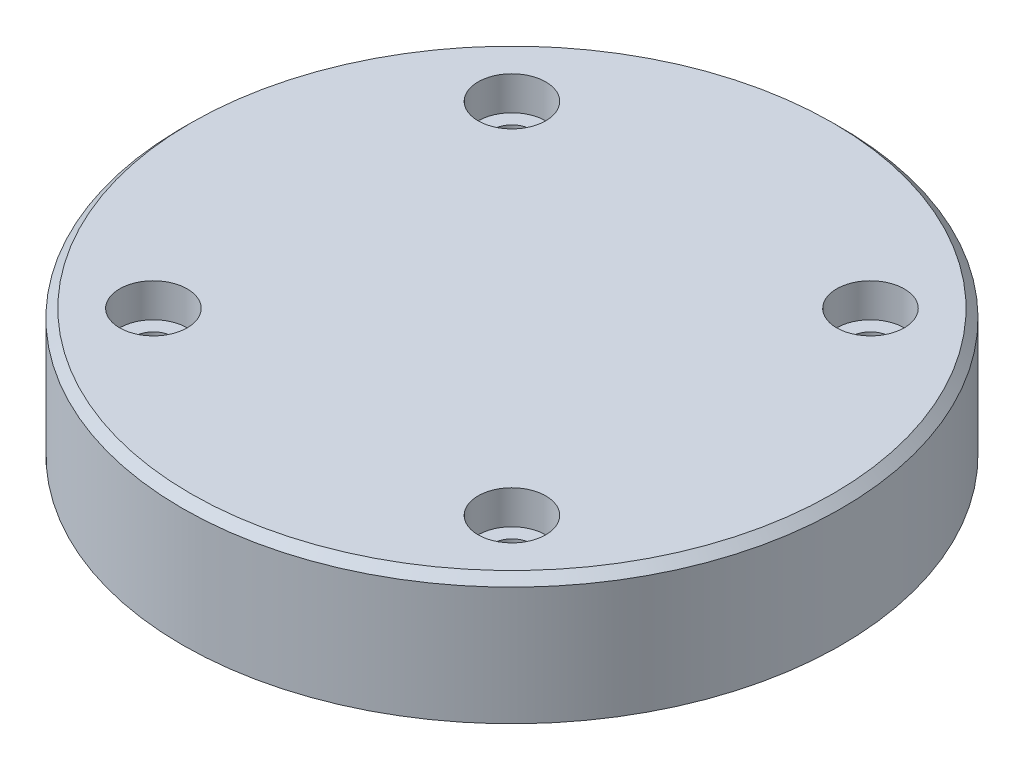
ISO-10303-21;
HEADER;
FILE_DESCRIPTION(('STEP AP214'),'2;1');
FILE_NAME('part.step','',(''),(''),'','','');
FILE_SCHEMA(('AUTOMOTIVE_DESIGN { 1 0 10303 214 1 1 1 1 }'));
ENDSEC;
DATA;
#1=APPLICATION_CONTEXT('core data for automotive mechanical design processes');
#2=APPLICATION_PROTOCOL_DEFINITION('international standard','automotive_design',2000,#1);
#3=PRODUCT_CONTEXT('',#1,'mechanical');
#4=PRODUCT('Part','Part','',(#3));
#5=PRODUCT_RELATED_PRODUCT_CATEGORY('part','',(#4));
#6=PRODUCT_DEFINITION_FORMATION('','',#4);
#7=PRODUCT_DEFINITION_CONTEXT('part definition',#1,'design');
#8=PRODUCT_DEFINITION('design','',#6,#7);
#9=PRODUCT_DEFINITION_SHAPE('','',#8);
#10=(LENGTH_UNIT() NAMED_UNIT(*) SI_UNIT(.MILLI.,.METRE.));
#11=(NAMED_UNIT(*) PLANE_ANGLE_UNIT() SI_UNIT($,.RADIAN.));
#12=(NAMED_UNIT(*) SI_UNIT($,.STERADIAN.) SOLID_ANGLE_UNIT());
#13=UNCERTAINTY_MEASURE_WITH_UNIT(LENGTH_MEASURE(1.E-05),#10,'distance_accuracy_value','');
#14=(GEOMETRIC_REPRESENTATION_CONTEXT(3) GLOBAL_UNCERTAINTY_ASSIGNED_CONTEXT((#13)) GLOBAL_UNIT_ASSIGNED_CONTEXT((#10,
#11,#12)) REPRESENTATION_CONTEXT('',''));
#15=CARTESIAN_POINT('',(0.,0.,0.));
#16=DIRECTION('',(0.,0.,1.));
#17=DIRECTION('',(1.,0.,0.));
#18=AXIS2_PLACEMENT_3D('',#15,#16,#17);
#19=CARTESIAN_POINT('',(0.,15.,0.));
#20=DIRECTION('',(0.,-1.,0.));
#21=DIRECTION('',(0.,0.,-1.));
#22=AXIS2_PLACEMENT_3D('',#19,#20,#21);
#23=CYLINDRICAL_SURFACE('',#22,39.);
#24=CARTESIAN_POINT('',(0.,14.,0.));
#25=DIRECTION('',(0.,1.,0.));
#26=DIRECTION('',(0.,0.,1.));
#27=AXIS2_PLACEMENT_3D('',#24,#25,#26);
#28=CIRCLE('',#27,39.);
#29=CARTESIAN_POINT('',(0.,14.,39.));
#30=VERTEX_POINT('',#29);
#31=EDGE_CURVE('E10',#30,#30,#28,.F.);
#32=ORIENTED_EDGE('',*,*,#31,.T.);
#33=EDGE_LOOP('',(#32));
#34=FACE_BOUND('',#33,.T.);
#35=CARTESIAN_POINT('',(0.,0.,0.));
#36=DIRECTION('',(0.,1.,0.));
#37=DIRECTION('',(0.,0.,1.));
#38=AXIS2_PLACEMENT_3D('',#35,#36,#37);
#39=CIRCLE('',#38,39.);
#40=CARTESIAN_POINT('',(0.,0.,39.));
#41=VERTEX_POINT('',#40);
#42=EDGE_CURVE('E46',#41,#41,#39,.T.);
#43=ORIENTED_EDGE('',*,*,#42,.T.);
#44=EDGE_LOOP('',(#43));
#45=FACE_BOUND('',#44,.T.);
#46=ADVANCED_FACE('F35',(#34,#45),#23,.T.);
#47=CARTESIAN_POINT('',(0.,15.,0.));
#48=DIRECTION('',(0.,1.,0.));
#49=DIRECTION('',(0.,0.,1.));
#50=AXIS2_PLACEMENT_3D('',#47,#48,#49);
#51=PLANE('',#50);
#52=CARTESIAN_POINT('',(0.,15.,0.));
#53=DIRECTION('',(0.,1.,0.));
#54=DIRECTION('',(0.,0.,1.));
#55=AXIS2_PLACEMENT_3D('',#52,#53,#54);
#56=CIRCLE('',#55,38.);
#57=CARTESIAN_POINT('',(0.,15.,38.));
#58=VERTEX_POINT('',#57);
#59=EDGE_CURVE('E42',#58,#58,#56,.T.);
#60=ORIENTED_EDGE('',*,*,#59,.T.);
#61=EDGE_LOOP('',(#60));
#62=FACE_BOUND('',#61,.T.);
#63=CARTESIAN_POINT('',(-21.2132034355964,15.,-21.2132034355965));
#64=DIRECTION('',(0.,1.,0.));
#65=DIRECTION('',(0.,0.,1.));
#66=AXIS2_PLACEMENT_3D('',#63,#64,#65);
#67=CIRCLE('',#66,4.);
#68=CARTESIAN_POINT('',(-21.2132034355964,15.,-17.2132034355965));
#69=VERTEX_POINT('',#68);
#70=EDGE_CURVE('E97',#69,#69,#67,.T.);
#71=ORIENTED_EDGE('',*,*,#70,.F.);
#72=EDGE_LOOP('',(#71));
#73=FACE_BOUND('',#72,.T.);
#74=CARTESIAN_POINT('',(-21.2132034355964,15.,21.2132034355965));
#75=DIRECTION('',(0.,1.,0.));
#76=DIRECTION('',(0.,0.,1.));
#77=AXIS2_PLACEMENT_3D('',#74,#75,#76);
#78=CIRCLE('',#77,4.);
#79=CARTESIAN_POINT('',(-21.2132034355964,15.,25.2132034355965));
#80=VERTEX_POINT('',#79);
#81=EDGE_CURVE('E85',#80,#80,#78,.T.);
#82=ORIENTED_EDGE('',*,*,#81,.F.);
#83=EDGE_LOOP('',(#82));
#84=FACE_BOUND('',#83,.T.);
#85=CARTESIAN_POINT('',(21.2132034355964,15.,21.2132034355965));
#86=DIRECTION('',(0.,1.,0.));
#87=DIRECTION('',(0.,0.,1.));
#88=AXIS2_PLACEMENT_3D('',#85,#86,#87);
#89=CIRCLE('',#88,4.);
#90=CARTESIAN_POINT('',(21.2132034355964,15.,25.2132034355964));
#91=VERTEX_POINT('',#90);
#92=EDGE_CURVE('E73',#91,#91,#89,.T.);
#93=ORIENTED_EDGE('',*,*,#92,.F.);
#94=EDGE_LOOP('',(#93));
#95=FACE_BOUND('',#94,.T.);
#96=CARTESIAN_POINT('',(21.2132034355964,15.,-21.2132034355965));
#97=DIRECTION('',(0.,1.,0.));
#98=DIRECTION('',(0.,0.,1.));
#99=AXIS2_PLACEMENT_3D('',#96,#97,#98);
#100=CIRCLE('',#99,4.);
#101=CARTESIAN_POINT('',(21.2132034355964,15.,-17.2132034355965));
#102=VERTEX_POINT('',#101);
#103=EDGE_CURVE('E61',#102,#102,#100,.T.);
#104=ORIENTED_EDGE('',*,*,#103,.F.);
#105=EDGE_LOOP('',(#104));
#106=FACE_BOUND('',#105,.T.);
#107=ADVANCED_FACE('F103',(#62,#73,#84,#95,#106),#51,.T.);
#108=CARTESIAN_POINT('',(0.,0.,0.));
#109=DIRECTION('',(0.,1.,0.));
#110=DIRECTION('',(0.,0.,1.));
#111=AXIS2_PLACEMENT_3D('',#108,#109,#110);
#112=PLANE('',#111);
#113=CARTESIAN_POINT('',(-21.2132034355964,0.,-21.2132034355965));
#114=DIRECTION('',(0.,1.,0.));
#115=DIRECTION('',(0.,0.,1.));
#116=AXIS2_PLACEMENT_3D('',#113,#114,#115);
#117=CIRCLE('',#116,2.25);
#118=CARTESIAN_POINT('',(-21.2132034355964,0.,-18.9632034355965));
#119=VERTEX_POINT('',#118);
#120=EDGE_CURVE('E88',#119,#119,#117,.T.);
#121=ORIENTED_EDGE('',*,*,#120,.T.);
#122=EDGE_LOOP('',(#121));
#123=FACE_BOUND('',#122,.T.);
#124=CARTESIAN_POINT('',(-21.2132034355964,0.,21.2132034355965));
#125=DIRECTION('',(0.,1.,0.));
#126=DIRECTION('',(0.,0.,1.));
#127=AXIS2_PLACEMENT_3D('',#124,#125,#126);
#128=CIRCLE('',#127,2.25);
#129=CARTESIAN_POINT('',(-21.2132034355964,0.,23.4632034355965));
#130=VERTEX_POINT('',#129);
#131=EDGE_CURVE('E76',#130,#130,#128,.T.);
#132=ORIENTED_EDGE('',*,*,#131,.T.);
#133=EDGE_LOOP('',(#132));
#134=FACE_BOUND('',#133,.T.);
#135=CARTESIAN_POINT('',(21.2132034355964,0.,21.2132034355965));
#136=DIRECTION('',(0.,1.,0.));
#137=DIRECTION('',(0.,0.,1.));
#138=AXIS2_PLACEMENT_3D('',#135,#136,#137);
#139=CIRCLE('',#138,2.25);
#140=CARTESIAN_POINT('',(21.2132034355964,0.,23.4632034355964));
#141=VERTEX_POINT('',#140);
#142=EDGE_CURVE('E64',#141,#141,#139,.T.);
#143=ORIENTED_EDGE('',*,*,#142,.T.);
#144=EDGE_LOOP('',(#143));
#145=FACE_BOUND('',#144,.T.);
#146=CARTESIAN_POINT('',(21.2132034355964,0.,-21.2132034355965));
#147=DIRECTION('',(0.,1.,0.));
#148=DIRECTION('',(0.,0.,1.));
#149=AXIS2_PLACEMENT_3D('',#146,#147,#148);
#150=CIRCLE('',#149,2.25);
#151=CARTESIAN_POINT('',(21.2132034355964,0.,-18.9632034355965));
#152=VERTEX_POINT('',#151);
#153=EDGE_CURVE('E50',#152,#152,#150,.T.);
#154=ORIENTED_EDGE('',*,*,#153,.T.);
#155=EDGE_LOOP('',(#154));
#156=FACE_BOUND('',#155,.T.);
#157=ORIENTED_EDGE('',*,*,#42,.F.);
#158=EDGE_LOOP('',(#157));
#159=FACE_BOUND('',#158,.T.);
#160=ADVANCED_FACE('F106',(#123,#134,#145,#156,#159),#112,.F.);
#161=CARTESIAN_POINT('',(21.2132034355964,15.,-21.2132034355965));
#162=DIRECTION('',(0.,1.,0.));
#163=DIRECTION('',(0.,0.,1.));
#164=AXIS2_PLACEMENT_3D('',#161,#162,#163);
#165=CYLINDRICAL_SURFACE('',#164,2.25);
#166=ORIENTED_EDGE('',*,*,#153,.F.);
#167=EDGE_LOOP('',(#166));
#168=FACE_BOUND('',#167,.T.);
#169=CARTESIAN_POINT('',(21.2132034355964,11.,-21.2132034355965));
#170=DIRECTION('',(0.,1.,0.));
#171=DIRECTION('',(0.,0.,1.));
#172=AXIS2_PLACEMENT_3D('',#169,#170,#171);
#173=CIRCLE('',#172,2.25);
#174=CARTESIAN_POINT('',(21.2132034355964,11.,-18.9632034355965));
#175=VERTEX_POINT('',#174);
#176=EDGE_CURVE('E55',#175,#175,#173,.T.);
#177=ORIENTED_EDGE('',*,*,#176,.T.);
#178=EDGE_LOOP('',(#177));
#179=FACE_BOUND('',#178,.T.);
#180=ADVANCED_FACE('F127',(#168,#179),#165,.F.);
#181=CARTESIAN_POINT('',(23.4632034355964,11.,-21.2132034355965));
#182=DIRECTION('',(0.,-1.,0.));
#183=DIRECTION('',(0.,0.,-1.));
#184=AXIS2_PLACEMENT_3D('',#181,#182,#183);
#185=PLANE('',#184);
#186=ORIENTED_EDGE('',*,*,#176,.F.);
#187=EDGE_LOOP('',(#186));
#188=FACE_BOUND('',#187,.T.);
#189=CARTESIAN_POINT('',(21.2132034355964,11.,-21.2132034355965));
#190=DIRECTION('',(0.,1.,0.));
#191=DIRECTION('',(0.,0.,1.));
#192=AXIS2_PLACEMENT_3D('',#189,#190,#191);
#193=CIRCLE('',#192,4.);
#194=CARTESIAN_POINT('',(21.2132034355964,11.,-17.2132034355965));
#195=VERTEX_POINT('',#194);
#196=EDGE_CURVE('E58',#195,#195,#193,.T.);
#197=ORIENTED_EDGE('',*,*,#196,.T.);
#198=EDGE_LOOP('',(#197));
#199=FACE_BOUND('',#198,.T.);
#200=ADVANCED_FACE('F117',(#188,#199),#185,.F.);
#201=CARTESIAN_POINT('',(21.2132034355964,15.,-21.2132034355965));
#202=DIRECTION('',(0.,1.,0.));
#203=DIRECTION('',(0.,0.,1.));
#204=AXIS2_PLACEMENT_3D('',#201,#202,#203);
#205=CYLINDRICAL_SURFACE('',#204,4.);
#206=ORIENTED_EDGE('',*,*,#196,.F.);
#207=EDGE_LOOP('',(#206));
#208=FACE_BOUND('',#207,.T.);
#209=ORIENTED_EDGE('',*,*,#103,.T.);
#210=EDGE_LOOP('',(#209));
#211=FACE_BOUND('',#210,.T.);
#212=ADVANCED_FACE('F114',(#208,#211),#205,.F.);
#213=CARTESIAN_POINT('',(21.2132034355964,15.,21.2132034355965));
#214=DIRECTION('',(0.,1.,0.));
#215=DIRECTION('',(0.,0.,1.));
#216=AXIS2_PLACEMENT_3D('',#213,#214,#215);
#217=CYLINDRICAL_SURFACE('',#216,2.25);
#218=ORIENTED_EDGE('',*,*,#142,.F.);
#219=EDGE_LOOP('',(#218));
#220=FACE_BOUND('',#219,.T.);
#221=CARTESIAN_POINT('',(21.2132034355964,11.,21.2132034355965));
#222=DIRECTION('',(0.,1.,0.));
#223=DIRECTION('',(0.,0.,1.));
#224=AXIS2_PLACEMENT_3D('',#221,#222,#223);
#225=CIRCLE('',#224,2.25);
#226=CARTESIAN_POINT('',(21.2132034355964,11.,23.4632034355965));
#227=VERTEX_POINT('',#226);
#228=EDGE_CURVE('E67',#227,#227,#225,.T.);
#229=ORIENTED_EDGE('',*,*,#228,.T.);
#230=EDGE_LOOP('',(#229));
#231=FACE_BOUND('',#230,.T.);
#232=ADVANCED_FACE('F116',(#220,#231),#217,.F.);
#233=CARTESIAN_POINT('',(23.4632034355964,11.,21.2132034355965));
#234=DIRECTION('',(0.,-1.,0.));
#235=DIRECTION('',(0.,0.,-1.));
#236=AXIS2_PLACEMENT_3D('',#233,#234,#235);
#237=PLANE('',#236);
#238=ORIENTED_EDGE('',*,*,#228,.F.);
#239=EDGE_LOOP('',(#238));
#240=FACE_BOUND('',#239,.T.);
#241=CARTESIAN_POINT('',(21.2132034355964,11.,21.2132034355965));
#242=DIRECTION('',(0.,1.,0.));
#243=DIRECTION('',(0.,0.,1.));
#244=AXIS2_PLACEMENT_3D('',#241,#242,#243);
#245=CIRCLE('',#244,4.);
#246=CARTESIAN_POINT('',(21.2132034355964,11.,25.2132034355965));
#247=VERTEX_POINT('',#246);
#248=EDGE_CURVE('E70',#247,#247,#245,.T.);
#249=ORIENTED_EDGE('',*,*,#248,.T.);
#250=EDGE_LOOP('',(#249));
#251=FACE_BOUND('',#250,.T.);
#252=ADVANCED_FACE('F124',(#240,#251),#237,.F.);
#253=CARTESIAN_POINT('',(21.2132034355964,15.,21.2132034355965));
#254=DIRECTION('',(0.,1.,0.));
#255=DIRECTION('',(0.,0.,1.));
#256=AXIS2_PLACEMENT_3D('',#253,#254,#255);
#257=CYLINDRICAL_SURFACE('',#256,4.);
#258=ORIENTED_EDGE('',*,*,#248,.F.);
#259=EDGE_LOOP('',(#258));
#260=FACE_BOUND('',#259,.T.);
#261=ORIENTED_EDGE('',*,*,#92,.T.);
#262=EDGE_LOOP('',(#261));
#263=FACE_BOUND('',#262,.T.);
#264=ADVANCED_FACE('F170',(#260,#263),#257,.F.);
#265=CARTESIAN_POINT('',(-21.2132034355964,15.,21.2132034355965));
#266=DIRECTION('',(0.,1.,0.));
#267=DIRECTION('',(0.,0.,1.));
#268=AXIS2_PLACEMENT_3D('',#265,#266,#267);
#269=CYLINDRICAL_SURFACE('',#268,2.25);
#270=ORIENTED_EDGE('',*,*,#131,.F.);
#271=EDGE_LOOP('',(#270));
#272=FACE_BOUND('',#271,.T.);
#273=CARTESIAN_POINT('',(-21.2132034355964,11.,21.2132034355965));
#274=DIRECTION('',(0.,1.,0.));
#275=DIRECTION('',(0.,0.,1.));
#276=AXIS2_PLACEMENT_3D('',#273,#274,#275);
#277=CIRCLE('',#276,2.25);
#278=CARTESIAN_POINT('',(-21.2132034355964,11.,23.4632034355965));
#279=VERTEX_POINT('',#278);
#280=EDGE_CURVE('E79',#279,#279,#277,.T.);
#281=ORIENTED_EDGE('',*,*,#280,.T.);
#282=EDGE_LOOP('',(#281));
#283=FACE_BOUND('',#282,.T.);
#284=ADVANCED_FACE('F178',(#272,#283),#269,.F.);
#285=CARTESIAN_POINT('',(-18.9632034355964,11.,21.2132034355965));
#286=DIRECTION('',(0.,-1.,0.));
#287=DIRECTION('',(0.,0.,-1.));
#288=AXIS2_PLACEMENT_3D('',#285,#286,#287);
#289=PLANE('',#288);
#290=ORIENTED_EDGE('',*,*,#280,.F.);
#291=EDGE_LOOP('',(#290));
#292=FACE_BOUND('',#291,.T.);
#293=CARTESIAN_POINT('',(-21.2132034355964,11.,21.2132034355965));
#294=DIRECTION('',(0.,1.,0.));
#295=DIRECTION('',(0.,0.,1.));
#296=AXIS2_PLACEMENT_3D('',#293,#294,#295);
#297=CIRCLE('',#296,4.);
#298=CARTESIAN_POINT('',(-21.2132034355964,11.,25.2132034355965));
#299=VERTEX_POINT('',#298);
#300=EDGE_CURVE('E82',#299,#299,#297,.T.);
#301=ORIENTED_EDGE('',*,*,#300,.T.);
#302=EDGE_LOOP('',(#301));
#303=FACE_BOUND('',#302,.T.);
#304=ADVANCED_FACE('F186',(#292,#303),#289,.F.);
#305=CARTESIAN_POINT('',(-21.2132034355964,15.,21.2132034355965));
#306=DIRECTION('',(0.,1.,0.));
#307=DIRECTION('',(0.,0.,1.));
#308=AXIS2_PLACEMENT_3D('',#305,#306,#307);
#309=CYLINDRICAL_SURFACE('',#308,4.);
#310=ORIENTED_EDGE('',*,*,#300,.F.);
#311=EDGE_LOOP('',(#310));
#312=FACE_BOUND('',#311,.T.);
#313=ORIENTED_EDGE('',*,*,#81,.T.);
#314=EDGE_LOOP('',(#313));
#315=FACE_BOUND('',#314,.T.);
#316=ADVANCED_FACE('F194',(#312,#315),#309,.F.);
#317=CARTESIAN_POINT('',(-21.2132034355964,15.,-21.2132034355965));
#318=DIRECTION('',(0.,1.,0.));
#319=DIRECTION('',(0.,0.,1.));
#320=AXIS2_PLACEMENT_3D('',#317,#318,#319);
#321=CYLINDRICAL_SURFACE('',#320,2.25);
#322=ORIENTED_EDGE('',*,*,#120,.F.);
#323=EDGE_LOOP('',(#322));
#324=FACE_BOUND('',#323,.T.);
#325=CARTESIAN_POINT('',(-21.2132034355964,11.,-21.2132034355965));
#326=DIRECTION('',(0.,1.,0.));
#327=DIRECTION('',(0.,0.,1.));
#328=AXIS2_PLACEMENT_3D('',#325,#326,#327);
#329=CIRCLE('',#328,2.25);
#330=CARTESIAN_POINT('',(-21.2132034355964,11.,-18.9632034355965));
#331=VERTEX_POINT('',#330);
#332=EDGE_CURVE('E91',#331,#331,#329,.T.);
#333=ORIENTED_EDGE('',*,*,#332,.T.);
#334=EDGE_LOOP('',(#333));
#335=FACE_BOUND('',#334,.T.);
#336=ADVANCED_FACE('F202',(#324,#335),#321,.F.);
#337=CARTESIAN_POINT('',(-18.9632034355964,11.,-21.2132034355965));
#338=DIRECTION('',(0.,-1.,0.));
#339=DIRECTION('',(0.,0.,-1.));
#340=AXIS2_PLACEMENT_3D('',#337,#338,#339);
#341=PLANE('',#340);
#342=ORIENTED_EDGE('',*,*,#332,.F.);
#343=EDGE_LOOP('',(#342));
#344=FACE_BOUND('',#343,.T.);
#345=CARTESIAN_POINT('',(-21.2132034355964,11.,-21.2132034355965));
#346=DIRECTION('',(0.,1.,0.));
#347=DIRECTION('',(0.,0.,1.));
#348=AXIS2_PLACEMENT_3D('',#345,#346,#347);
#349=CIRCLE('',#348,4.);
#350=CARTESIAN_POINT('',(-21.2132034355964,11.,-17.2132034355965));
#351=VERTEX_POINT('',#350);
#352=EDGE_CURVE('E94',#351,#351,#349,.T.);
#353=ORIENTED_EDGE('',*,*,#352,.T.);
#354=EDGE_LOOP('',(#353));
#355=FACE_BOUND('',#354,.T.);
#356=ADVANCED_FACE('F210',(#344,#355),#341,.F.);
#357=CARTESIAN_POINT('',(-21.2132034355964,15.,-21.2132034355965));
#358=DIRECTION('',(0.,1.,0.));
#359=DIRECTION('',(0.,0.,1.));
#360=AXIS2_PLACEMENT_3D('',#357,#358,#359);
#361=CYLINDRICAL_SURFACE('',#360,4.);
#362=ORIENTED_EDGE('',*,*,#352,.F.);
#363=EDGE_LOOP('',(#362));
#364=FACE_BOUND('',#363,.T.);
#365=ORIENTED_EDGE('',*,*,#70,.T.);
#366=EDGE_LOOP('',(#365));
#367=FACE_BOUND('',#366,.T.);
#368=ADVANCED_FACE('F101',(#364,#367),#361,.F.);
#369=CARTESIAN_POINT('',(0.,15.,0.));
#370=DIRECTION('',(0.,-1.,0.));
#371=DIRECTION('',(0.,0.,-1.));
#372=AXIS2_PLACEMENT_3D('',#369,#370,#371);
#373=CONICAL_SURFACE('',#372,38.,0.785398163397448);
#374=ORIENTED_EDGE('',*,*,#31,.F.);
#375=EDGE_LOOP('',(#374));
#376=FACE_BOUND('',#375,.T.);
#377=ORIENTED_EDGE('',*,*,#59,.F.);
#378=EDGE_LOOP('',(#377));
#379=FACE_BOUND('',#378,.T.);
#380=ADVANCED_FACE('F37',(#376,#379),#373,.T.);
#381=CLOSED_SHELL('',(#46,#107,#160,#180,#200,#212,#232,#252,#264,#284,#304,#316,#336,#356,#368,#380));
#382=MANIFOLD_SOLID_BREP('B2',#381);
#383=ADVANCED_BREP_SHAPE_REPRESENTATION('',(#18,#382),#14);
#384=SHAPE_DEFINITION_REPRESENTATION(#9,#383);
ENDSEC;
END-ISO-10303-21;
